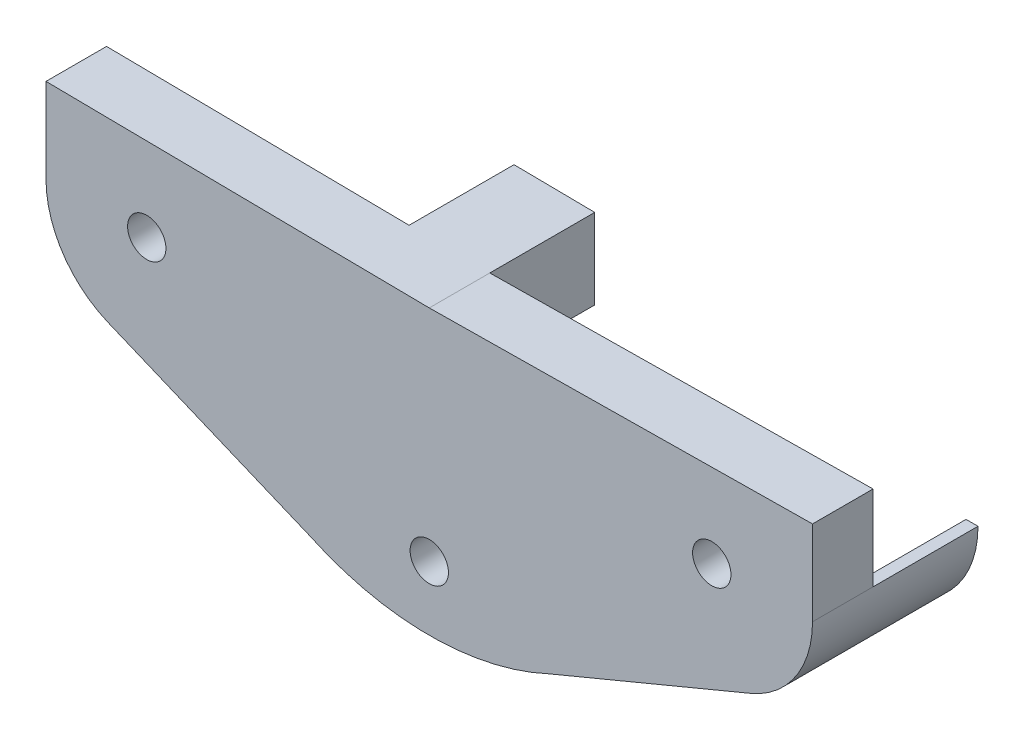
ISO-10303-21;
HEADER;
FILE_DESCRIPTION(('STEP AP214'),'2;1');
FILE_NAME('part.step','',(''),(''),'','','');
FILE_SCHEMA(('AUTOMOTIVE_DESIGN { 1 0 10303 214 1 1 1 1 }'));
ENDSEC;
DATA;
#1=APPLICATION_CONTEXT('core data for automotive mechanical design processes');
#2=APPLICATION_PROTOCOL_DEFINITION('international standard','automotive_design',2000,#1);
#3=PRODUCT_CONTEXT('',#1,'mechanical');
#4=PRODUCT('Part','Part','',(#3));
#5=PRODUCT_RELATED_PRODUCT_CATEGORY('part','',(#4));
#6=PRODUCT_DEFINITION_FORMATION('','',#4);
#7=PRODUCT_DEFINITION_CONTEXT('part definition',#1,'design');
#8=PRODUCT_DEFINITION('design','',#6,#7);
#9=PRODUCT_DEFINITION_SHAPE('','',#8);
#10=(LENGTH_UNIT() NAMED_UNIT(*) SI_UNIT(.MILLI.,.METRE.));
#11=(NAMED_UNIT(*) PLANE_ANGLE_UNIT() SI_UNIT($,.RADIAN.));
#12=(NAMED_UNIT(*) SI_UNIT($,.STERADIAN.) SOLID_ANGLE_UNIT());
#13=UNCERTAINTY_MEASURE_WITH_UNIT(LENGTH_MEASURE(1.E-05),#10,'distance_accuracy_value','');
#14=(GEOMETRIC_REPRESENTATION_CONTEXT(3) GLOBAL_UNCERTAINTY_ASSIGNED_CONTEXT((#13)) GLOBAL_UNIT_ASSIGNED_CONTEXT((#10,
#11,#12)) REPRESENTATION_CONTEXT('',''));
#15=CARTESIAN_POINT('',(0.,0.,0.));
#16=DIRECTION('',(0.,0.,1.));
#17=DIRECTION('',(1.,0.,0.));
#18=AXIS2_PLACEMENT_3D('',#15,#16,#17);
#19=CARTESIAN_POINT('',(-14.,0.0761161548422696,3.));
#20=DIRECTION('',(0.,0.,-1.));
#21=DIRECTION('',(-1.,0.,0.));
#22=AXIS2_PLACEMENT_3D('',#19,#20,#21);
#23=PLANE('',#22);
#24=DIRECTION('',(-0.999928879078218,-0.0119263064432308,0.));
#25=VECTOR('',#24,1.);
#26=CARTESIAN_POINT('',(18.9924278789332,4.2760258409828,3.));
#27=LINE('',#26,#25);
#28=CARTESIAN_POINT('',(18.9924278789332,4.2760258409828,3.));
#29=VERTEX_POINT('',#28);
#30=CARTESIAN_POINT('',(0.,4.04950021528638,3.));
#31=VERTEX_POINT('',#30);
#32=EDGE_CURVE('E225',#29,#31,#27,.T.);
#33=ORIENTED_EDGE('',*,*,#32,.T.);
#34=DIRECTION('',(-0.999928879078218,0.0119263064432308,0.));
#35=VECTOR('',#34,1.);
#36=CARTESIAN_POINT('',(-18.9924278789332,4.2760258409828,3.));
#37=LINE('',#36,#35);
#38=CARTESIAN_POINT('',(-18.9924278789332,4.2760258409828,3.));
#39=VERTEX_POINT('',#38);
#40=EDGE_CURVE('E228',#31,#39,#37,.T.);
#41=ORIENTED_EDGE('',*,*,#40,.T.);
#42=DIRECTION('',(0.,-1.,0.));
#43=VECTOR('',#42,1.);
#44=CARTESIAN_POINT('',(-18.9924278789332,0.0761161548422696,3.));
#45=LINE('',#44,#43);
#46=CARTESIAN_POINT('',(-18.9924278789332,0.0761161548422696,3.));
#47=VERTEX_POINT('',#46);
#48=EDGE_CURVE('E231',#39,#47,#45,.T.);
#49=ORIENTED_EDGE('',*,*,#48,.T.);
#50=CARTESIAN_POINT('',(-14.,0.0761161548422696,3.));
#51=DIRECTION('',(0.,0.,1.));
#52=DIRECTION('',(-1.,0.,0.));
#53=AXIS2_PLACEMENT_3D('',#50,#51,#52);
#54=CIRCLE('',#53,4.99242787893324);
#55=CARTESIAN_POINT('',(-15.9179901286796,-4.53318422511101,3.));
#56=VERTEX_POINT('',#55);
#57=EDGE_CURVE('E233',#47,#56,#54,.T.);
#58=ORIENTED_EDGE('',*,*,#57,.T.);
#59=DIRECTION('',(0.923258280686105,-0.384179836983328,0.));
#60=VECTOR('',#59,1.);
#61=CARTESIAN_POINT('',(-5.94246213828742,-8.68413179562563,3.));
#62=LINE('',#61,#60);
#63=CARTESIAN_POINT('',(-5.94246213828742,-8.68413179562563,3.));
#64=VERTEX_POINT('',#63);
#65=EDGE_CURVE('E235',#56,#64,#62,.T.);
#66=ORIENTED_EDGE('',*,*,#65,.T.);
#67=CARTESIAN_POINT('',(0.,4.04950021528638,3.));
#68=DIRECTION('',(0.,0.,1.));
#69=DIRECTION('',(1.,0.,0.));
#70=AXIS2_PLACEMENT_3D('',#67,#68,#69);
#71=CIRCLE('',#70,14.05198350605);
#72=CARTESIAN_POINT('',(5.94246213828742,-8.68413179562563,3.));
#73=VERTEX_POINT('',#72);
#74=EDGE_CURVE('E237',#64,#73,#71,.T.);
#75=ORIENTED_EDGE('',*,*,#74,.T.);
#76=DIRECTION('',(0.923258280686105,0.384179836983328,0.));
#77=VECTOR('',#76,1.);
#78=CARTESIAN_POINT('',(5.94246213828742,-8.68413179562563,3.));
#79=LINE('',#78,#77);
#80=CARTESIAN_POINT('',(15.9179901286796,-4.53318422511101,3.));
#81=VERTEX_POINT('',#80);
#82=EDGE_CURVE('E239',#73,#81,#79,.T.);
#83=ORIENTED_EDGE('',*,*,#82,.T.);
#84=CARTESIAN_POINT('',(14.,0.0761161548422696,3.));
#85=DIRECTION('',(0.,0.,1.));
#86=DIRECTION('',(1.,0.,0.));
#87=AXIS2_PLACEMENT_3D('',#84,#85,#86);
#88=CIRCLE('',#87,4.99242787893324);
#89=CARTESIAN_POINT('',(18.9924278789332,0.0761161548422696,3.));
#90=VERTEX_POINT('',#89);
#91=EDGE_CURVE('E241',#81,#90,#88,.T.);
#92=ORIENTED_EDGE('',*,*,#91,.T.);
#93=DIRECTION('',(0.,1.,0.));
#94=VECTOR('',#93,1.);
#95=CARTESIAN_POINT('',(18.9924278789332,0.0761161548422696,3.));
#96=LINE('',#95,#94);
#97=EDGE_CURVE('E243',#90,#29,#96,.T.);
#98=ORIENTED_EDGE('',*,*,#97,.T.);
#99=EDGE_LOOP('',(#33,#41,#49,#58,#66,#75,#83,#92,#98));
#100=FACE_BOUND('',#99,.T.);
#101=CARTESIAN_POINT('',(-14.,0.0761161548422696,3.));
#102=DIRECTION('',(0.,0.,1.));
#103=DIRECTION('',(1.,0.,0.));
#104=AXIS2_PLACEMENT_3D('',#101,#102,#103);
#105=CIRCLE('',#104,0.949999999999999);
#106=CARTESIAN_POINT('',(-13.05,0.0761161548422696,3.));
#107=VERTEX_POINT('',#106);
#108=EDGE_CURVE('E219',#107,#107,#105,.T.);
#109=ORIENTED_EDGE('',*,*,#108,.F.);
#110=EDGE_LOOP('',(#109));
#111=FACE_BOUND('',#110,.T.);
#112=CARTESIAN_POINT('',(14.,0.0761161548422696,3.));
#113=DIRECTION('',(0.,0.,1.));
#114=DIRECTION('',(-1.,0.,0.));
#115=AXIS2_PLACEMENT_3D('',#112,#113,#114);
#116=CIRCLE('',#115,0.949999999999999);
#117=CARTESIAN_POINT('',(13.05,0.0761161548422696,3.));
#118=VERTEX_POINT('',#117);
#119=EDGE_CURVE('E213',#118,#118,#116,.T.);
#120=ORIENTED_EDGE('',*,*,#119,.F.);
#121=EDGE_LOOP('',(#120));
#122=FACE_BOUND('',#121,.T.);
#123=CARTESIAN_POINT('',(0.,-6.83451712184535,3.));
#124=DIRECTION('',(0.,0.,1.));
#125=DIRECTION('',(1.,0.,0.));
#126=AXIS2_PLACEMENT_3D('',#123,#124,#125);
#127=CIRCLE('',#126,0.95);
#128=CARTESIAN_POINT('',(0.95,-6.83451712184535,3.));
#129=VERTEX_POINT('',#128);
#130=EDGE_CURVE('E207',#129,#129,#127,.T.);
#131=ORIENTED_EDGE('',*,*,#130,.F.);
#132=EDGE_LOOP('',(#131));
#133=FACE_BOUND('',#132,.T.);
#134=ADVANCED_FACE('F35',(#100,#111,#122,#133),#23,.F.);
#135=CARTESIAN_POINT('',(-14.,0.0761161548422696,0.));
#136=DIRECTION('',(0.,0.,-1.));
#137=DIRECTION('',(-1.,0.,0.));
#138=AXIS2_PLACEMENT_3D('',#135,#136,#137);
#139=PLANE('',#138);
#140=DIRECTION('',(0.,-1.,0.));
#141=VECTOR('',#140,1.);
#142=CARTESIAN_POINT('',(-3.99971551631287,0.,0.));
#143=LINE('',#142,#141);
#144=CARTESIAN_POINT('',(-3.99971551631287,4.0972054410593,0.));
#145=VERTEX_POINT('',#144);
#146=CARTESIAN_POINT('',(-3.99971551631287,0.,0.));
#147=VERTEX_POINT('',#146);
#148=EDGE_CURVE('E50',#145,#147,#143,.T.);
#149=ORIENTED_EDGE('',*,*,#148,.T.);
#150=DIRECTION('',(0.999818971255913,0.0190269471216064,0.));
#151=VECTOR('',#150,1.);
#152=CARTESIAN_POINT('',(-0.00144799587694737,0.0760885989128714,0.));
#153=LINE('',#152,#151);
#154=CARTESIAN_POINT('',(0.,0.0761161548422696,0.));
#155=VERTEX_POINT('',#154);
#156=EDGE_CURVE('E150',#147,#155,#153,.T.);
#157=ORIENTED_EDGE('',*,*,#156,.T.);
#158=DIRECTION('',(0.,-1.,0.));
#159=VECTOR('',#158,1.);
#160=CARTESIAN_POINT('',(0.,0.,0.));
#161=LINE('',#160,#159);
#162=CARTESIAN_POINT('',(0.,4.04950021528637,0.));
#163=VERTEX_POINT('',#162);
#164=EDGE_CURVE('E161',#163,#155,#161,.T.);
#165=ORIENTED_EDGE('',*,*,#164,.F.);
#166=DIRECTION('',(-0.999928879078218,-0.0119263064432308,0.));
#167=VECTOR('',#166,1.);
#168=CARTESIAN_POINT('',(18.9924278789332,4.2760258409828,0.));
#169=LINE('',#168,#167);
#170=CARTESIAN_POINT('',(18.9924278789332,4.2760258409828,0.));
#171=VERTEX_POINT('',#170);
#172=EDGE_CURVE('E222',#171,#163,#169,.T.);
#173=ORIENTED_EDGE('',*,*,#172,.F.);
#174=DIRECTION('',(0.,1.,0.));
#175=VECTOR('',#174,1.);
#176=CARTESIAN_POINT('',(18.9924278789332,0.0761161548422696,0.));
#177=LINE('',#176,#175);
#178=CARTESIAN_POINT('',(18.9924278789332,0.0761161548422696,0.));
#179=VERTEX_POINT('',#178);
#180=EDGE_CURVE('E229',#179,#171,#177,.T.);
#181=ORIENTED_EDGE('',*,*,#180,.F.);
#182=DIRECTION('',(1.,0.,0.));
#183=VECTOR('',#182,1.);
#184=CARTESIAN_POINT('',(0.,0.0761161548422733,0.));
#185=LINE('',#184,#183);
#186=CARTESIAN_POINT('',(18.4,0.0761161548422704,0.));
#187=VERTEX_POINT('',#186);
#188=EDGE_CURVE('E191',#187,#179,#185,.T.);
#189=ORIENTED_EDGE('',*,*,#188,.F.);
#190=CARTESIAN_POINT('',(14.,0.0761161548422696,0.));
#191=DIRECTION('',(0.,0.,-1.));
#192=DIRECTION('',(-1.,0.,0.));
#193=AXIS2_PLACEMENT_3D('',#190,#191,#192);
#194=CIRCLE('',#193,4.4);
#195=CARTESIAN_POINT('',(15.6903912827266,-3.98622028017659,0.));
#196=VERTEX_POINT('',#195);
#197=EDGE_CURVE('E58',#187,#196,#194,.T.);
#198=ORIENTED_EDGE('',*,*,#197,.T.);
#199=DIRECTION('',(-0.384179836983324,0.923258280686107,0.));
#200=VECTOR('',#199,1.);
#201=CARTESIAN_POINT('',(11.960680128174,4.97699531970277,0.));
#202=LINE('',#201,#200);
#203=CARTESIAN_POINT('',(15.9179901286796,-4.53318422511101,0.));
#204=VERTEX_POINT('',#203);
#205=EDGE_CURVE('E183',#204,#196,#202,.T.);
#206=ORIENTED_EDGE('',*,*,#205,.F.);
#207=DIRECTION('',(0.923258280686105,0.384179836983328,0.));
#208=VECTOR('',#207,1.);
#209=CARTESIAN_POINT('',(5.94246213828742,-8.68413179562563,0.));
#210=LINE('',#209,#208);
#211=CARTESIAN_POINT('',(5.94246213828742,-8.68413179562563,0.));
#212=VERTEX_POINT('',#211);
#213=EDGE_CURVE('E258',#212,#204,#210,.T.);
#214=ORIENTED_EDGE('',*,*,#213,.F.);
#215=CARTESIAN_POINT('',(0.,4.04950021528638,0.));
#216=DIRECTION('',(0.,0.,1.));
#217=DIRECTION('',(1.,0.,0.));
#218=AXIS2_PLACEMENT_3D('',#215,#216,#217);
#219=CIRCLE('',#218,14.05198350605);
#220=CARTESIAN_POINT('',(-5.94246213828742,-8.68413179562563,0.));
#221=VERTEX_POINT('',#220);
#222=EDGE_CURVE('E256',#221,#212,#219,.T.);
#223=ORIENTED_EDGE('',*,*,#222,.F.);
#224=DIRECTION('',(0.923258280686105,-0.384179836983328,0.));
#225=VECTOR('',#224,1.);
#226=CARTESIAN_POINT('',(-5.94246213828742,-8.68413179562563,0.));
#227=LINE('',#226,#225);
#228=CARTESIAN_POINT('',(-15.9179901286796,-4.53318422511101,0.));
#229=VERTEX_POINT('',#228);
#230=EDGE_CURVE('E254',#229,#221,#227,.T.);
#231=ORIENTED_EDGE('',*,*,#230,.F.);
#232=CARTESIAN_POINT('',(-14.,0.0761161548422696,0.));
#233=DIRECTION('',(0.,0.,1.));
#234=DIRECTION('',(-1.,0.,0.));
#235=AXIS2_PLACEMENT_3D('',#232,#233,#234);
#236=CIRCLE('',#235,4.99242787893324);
#237=CARTESIAN_POINT('',(-18.9924278789332,0.0761161548422696,0.));
#238=VERTEX_POINT('',#237);
#239=EDGE_CURVE('E252',#238,#229,#236,.T.);
#240=ORIENTED_EDGE('',*,*,#239,.F.);
#241=DIRECTION('',(0.,-1.,0.));
#242=VECTOR('',#241,1.);
#243=CARTESIAN_POINT('',(-18.9924278789332,0.0761161548422696,0.));
#244=LINE('',#243,#242);
#245=CARTESIAN_POINT('',(-18.9924278789332,4.2760258409828,0.));
#246=VERTEX_POINT('',#245);
#247=EDGE_CURVE('E250',#246,#238,#244,.T.);
#248=ORIENTED_EDGE('',*,*,#247,.F.);
#249=DIRECTION('',(-0.999928879078218,0.0119263064432308,0.));
#250=VECTOR('',#249,1.);
#251=CARTESIAN_POINT('',(-18.9924278789332,4.2760258409828,0.));
#252=LINE('',#251,#250);
#253=EDGE_CURVE('E248',#145,#246,#252,.T.);
#254=ORIENTED_EDGE('',*,*,#253,.F.);
#255=EDGE_LOOP('',(#149,#157,#165,#173,#181,#189,#198,#206,#214,#223,#231,#240,#248,#254));
#256=FACE_BOUND('',#255,.T.);
#257=CARTESIAN_POINT('',(14.,0.0761161548422696,0.));
#258=DIRECTION('',(0.,0.,1.));
#259=DIRECTION('',(-1.,0.,0.));
#260=AXIS2_PLACEMENT_3D('',#257,#258,#259);
#261=CIRCLE('',#260,0.949999999999999);
#262=CARTESIAN_POINT('',(13.05,0.0761161548422696,0.));
#263=VERTEX_POINT('',#262);
#264=EDGE_CURVE('E210',#263,#263,#261,.T.);
#265=ORIENTED_EDGE('',*,*,#264,.T.);
#266=EDGE_LOOP('',(#265));
#267=FACE_BOUND('',#266,.T.);
#268=CARTESIAN_POINT('',(-14.,0.0761161548422696,0.));
#269=DIRECTION('',(0.,0.,1.));
#270=DIRECTION('',(1.,0.,0.));
#271=AXIS2_PLACEMENT_3D('',#268,#269,#270);
#272=CIRCLE('',#271,0.949999999999999);
#273=CARTESIAN_POINT('',(-13.05,0.0761161548422696,0.));
#274=VERTEX_POINT('',#273);
#275=EDGE_CURVE('E216',#274,#274,#272,.T.);
#276=ORIENTED_EDGE('',*,*,#275,.T.);
#277=EDGE_LOOP('',(#276));
#278=FACE_BOUND('',#277,.T.);
#279=CARTESIAN_POINT('',(0.,-6.83451712184535,0.));
#280=DIRECTION('',(0.,0.,1.));
#281=DIRECTION('',(1.,0.,0.));
#282=AXIS2_PLACEMENT_3D('',#279,#280,#281);
#283=CIRCLE('',#282,0.95);
#284=CARTESIAN_POINT('',(0.95,-6.83451712184535,0.));
#285=VERTEX_POINT('',#284);
#286=EDGE_CURVE('E206',#285,#285,#283,.T.);
#287=ORIENTED_EDGE('',*,*,#286,.T.);
#288=EDGE_LOOP('',(#287));
#289=FACE_BOUND('',#288,.T.);
#290=ADVANCED_FACE('F291',(#256,#267,#278,#289),#139,.T.);
#291=CARTESIAN_POINT('',(18.9924278789332,4.2760258409828,3.));
#292=DIRECTION('',(0.0119263064432308,-0.999928879078218,0.));
#293=DIRECTION('',(0.999928879078218,0.0119263064432308,0.));
#294=AXIS2_PLACEMENT_3D('',#291,#292,#293);
#295=PLANE('',#294);
#296=ORIENTED_EDGE('',*,*,#172,.T.);
#297=DIRECTION('',(0.,0.,-1.));
#298=VECTOR('',#297,1.);
#299=CARTESIAN_POINT('',(0.,4.04950021528638,3.));
#300=LINE('',#299,#298);
#301=EDGE_CURVE('E11',#31,#163,#300,.T.);
#302=ORIENTED_EDGE('',*,*,#301,.F.);
#303=ORIENTED_EDGE('',*,*,#32,.F.);
#304=DIRECTION('',(0.,0.,-1.));
#305=VECTOR('',#304,1.);
#306=CARTESIAN_POINT('',(18.9924278789332,4.2760258409828,3.));
#307=LINE('',#306,#305);
#308=EDGE_CURVE('E245',#29,#171,#307,.T.);
#309=ORIENTED_EDGE('',*,*,#308,.T.);
#310=EDGE_LOOP('',(#296,#302,#303,#309));
#311=FACE_BOUND('',#310,.T.);
#312=ADVANCED_FACE('F37',(#311),#295,.F.);
#313=CARTESIAN_POINT('',(-18.9924278789332,4.2760258409828,3.));
#314=DIRECTION('',(-0.0119263064432308,-0.999928879078218,0.));
#315=DIRECTION('',(0.999928879078218,-0.0119263064432308,0.));
#316=AXIS2_PLACEMENT_3D('',#313,#314,#315);
#317=PLANE('',#316);
#318=ORIENTED_EDGE('',*,*,#301,.T.);
#319=DIRECTION('',(0.,0.,1.));
#320=VECTOR('',#319,1.);
#321=CARTESIAN_POINT('',(0.,4.04950021528637,-5.2));
#322=LINE('',#321,#320);
#323=CARTESIAN_POINT('',(0.,4.04950021528637,-5.2));
#324=VERTEX_POINT('',#323);
#325=EDGE_CURVE('E176',#324,#163,#322,.T.);
#326=ORIENTED_EDGE('',*,*,#325,.F.);
#327=DIRECTION('',(0.999928879078218,-0.0119263064432308,0.));
#328=VECTOR('',#327,1.);
#329=CARTESIAN_POINT('',(0.0482921456832308,4.04892422739337,-5.2));
#330=LINE('',#329,#328);
#331=CARTESIAN_POINT('',(-3.99971551631287,4.0972054410593,-5.2));
#332=VERTEX_POINT('',#331);
#333=EDGE_CURVE('E165',#332,#324,#330,.T.);
#334=ORIENTED_EDGE('',*,*,#333,.F.);
#335=DIRECTION('',(0.,0.,1.));
#336=VECTOR('',#335,1.);
#337=CARTESIAN_POINT('',(-3.99971551631287,4.0972054410593,-5.2));
#338=LINE('',#337,#336);
#339=EDGE_CURVE('E152',#332,#145,#338,.T.);
#340=ORIENTED_EDGE('',*,*,#339,.T.);
#341=ORIENTED_EDGE('',*,*,#253,.T.);
#342=DIRECTION('',(0.,0.,-1.));
#343=VECTOR('',#342,1.);
#344=CARTESIAN_POINT('',(-18.9924278789332,4.2760258409828,3.));
#345=LINE('',#344,#343);
#346=EDGE_CURVE('E43',#39,#246,#345,.T.);
#347=ORIENTED_EDGE('',*,*,#346,.F.);
#348=ORIENTED_EDGE('',*,*,#40,.F.);
#349=EDGE_LOOP('',(#318,#326,#334,#340,#341,#347,#348));
#350=FACE_BOUND('',#349,.T.);
#351=ADVANCED_FACE('F309',(#350),#317,.F.);
#352=CARTESIAN_POINT('',(-18.9924278789332,0.0761161548422696,3.));
#353=DIRECTION('',(1.,0.,0.));
#354=DIRECTION('',(0.,0.,-1.));
#355=AXIS2_PLACEMENT_3D('',#352,#353,#354);
#356=PLANE('',#355);
#357=ORIENTED_EDGE('',*,*,#247,.T.);
#358=DIRECTION('',(0.,0.,-1.));
#359=VECTOR('',#358,1.);
#360=CARTESIAN_POINT('',(-18.9924278789332,0.0761161548422696,3.));
#361=LINE('',#360,#359);
#362=EDGE_CURVE('E279',#47,#238,#361,.T.);
#363=ORIENTED_EDGE('',*,*,#362,.F.);
#364=ORIENTED_EDGE('',*,*,#48,.F.);
#365=ORIENTED_EDGE('',*,*,#346,.T.);
#366=EDGE_LOOP('',(#357,#363,#364,#365));
#367=FACE_BOUND('',#366,.T.);
#368=ADVANCED_FACE('F286',(#367),#356,.F.);
#369=CARTESIAN_POINT('',(-14.,0.0761161548422696,3.));
#370=DIRECTION('',(0.,0.,-1.));
#371=DIRECTION('',(-1.,0.,0.));
#372=AXIS2_PLACEMENT_3D('',#369,#370,#371);
#373=CYLINDRICAL_SURFACE('',#372,4.99242787893324);
#374=ORIENTED_EDGE('',*,*,#239,.T.);
#375=DIRECTION('',(0.,0.,-1.));
#376=VECTOR('',#375,1.);
#377=CARTESIAN_POINT('',(-15.9179901286796,-4.53318422511101,3.));
#378=LINE('',#377,#376);
#379=EDGE_CURVE('E276',#56,#229,#378,.T.);
#380=ORIENTED_EDGE('',*,*,#379,.F.);
#381=ORIENTED_EDGE('',*,*,#57,.F.);
#382=ORIENTED_EDGE('',*,*,#362,.T.);
#383=EDGE_LOOP('',(#374,#380,#381,#382));
#384=FACE_BOUND('',#383,.T.);
#385=ADVANCED_FACE('F297',(#384),#373,.T.);
#386=CARTESIAN_POINT('',(-5.94246213828742,-8.68413179562563,3.));
#387=DIRECTION('',(0.384179836983328,0.923258280686105,0.));
#388=DIRECTION('',(-0.923258280686105,0.384179836983328,0.));
#389=AXIS2_PLACEMENT_3D('',#386,#387,#388);
#390=PLANE('',#389);
#391=ORIENTED_EDGE('',*,*,#230,.T.);
#392=DIRECTION('',(0.,0.,-1.));
#393=VECTOR('',#392,1.);
#394=CARTESIAN_POINT('',(-5.94246213828742,-8.68413179562563,3.));
#395=LINE('',#394,#393);
#396=EDGE_CURVE('E273',#64,#221,#395,.T.);
#397=ORIENTED_EDGE('',*,*,#396,.F.);
#398=ORIENTED_EDGE('',*,*,#65,.F.);
#399=ORIENTED_EDGE('',*,*,#379,.T.);
#400=EDGE_LOOP('',(#391,#397,#398,#399));
#401=FACE_BOUND('',#400,.T.);
#402=ADVANCED_FACE('F301',(#401),#390,.F.);
#403=CARTESIAN_POINT('',(0.,4.04950021528638,3.));
#404=DIRECTION('',(0.,0.,-1.));
#405=DIRECTION('',(-1.,0.,0.));
#406=AXIS2_PLACEMENT_3D('',#403,#404,#405);
#407=CYLINDRICAL_SURFACE('',#406,14.05198350605);
#408=ORIENTED_EDGE('',*,*,#222,.T.);
#409=DIRECTION('',(0.,0.,-1.));
#410=VECTOR('',#409,1.);
#411=CARTESIAN_POINT('',(5.94246213828742,-8.68413179562563,3.));
#412=LINE('',#411,#410);
#413=EDGE_CURVE('E270',#73,#212,#412,.T.);
#414=ORIENTED_EDGE('',*,*,#413,.F.);
#415=ORIENTED_EDGE('',*,*,#74,.F.);
#416=ORIENTED_EDGE('',*,*,#396,.T.);
#417=EDGE_LOOP('',(#408,#414,#415,#416));
#418=FACE_BOUND('',#417,.T.);
#419=ADVANCED_FACE('F346',(#418),#407,.T.);
#420=CARTESIAN_POINT('',(5.94246213828742,-8.68413179562563,3.));
#421=DIRECTION('',(-0.384179836983328,0.923258280686105,0.));
#422=DIRECTION('',(-0.923258280686105,-0.384179836983328,0.));
#423=AXIS2_PLACEMENT_3D('',#420,#421,#422);
#424=PLANE('',#423);
#425=ORIENTED_EDGE('',*,*,#213,.T.);
#426=DIRECTION('',(0.,0.,-1.));
#427=VECTOR('',#426,1.);
#428=CARTESIAN_POINT('',(15.9179901286796,-4.53318422511101,3.));
#429=LINE('',#428,#427);
#430=EDGE_CURVE('E267',#81,#204,#429,.T.);
#431=ORIENTED_EDGE('',*,*,#430,.F.);
#432=ORIENTED_EDGE('',*,*,#82,.F.);
#433=ORIENTED_EDGE('',*,*,#413,.T.);
#434=EDGE_LOOP('',(#425,#431,#432,#433));
#435=FACE_BOUND('',#434,.T.);
#436=ADVANCED_FACE('F342',(#435),#424,.F.);
#437=CARTESIAN_POINT('',(14.,0.0761161548422696,3.));
#438=DIRECTION('',(0.,0.,-1.));
#439=DIRECTION('',(-1.,0.,0.));
#440=AXIS2_PLACEMENT_3D('',#437,#438,#439);
#441=CYLINDRICAL_SURFACE('',#440,4.99242787893324);
#442=ORIENTED_EDGE('',*,*,#430,.T.);
#443=DIRECTION('',(0.,0.,1.));
#444=VECTOR('',#443,1.);
#445=CARTESIAN_POINT('',(15.9179901286796,-4.53318422511101,-5.2));
#446=LINE('',#445,#444);
#447=CARTESIAN_POINT('',(15.9179901286796,-4.53318422511101,-5.2));
#448=VERTEX_POINT('',#447);
#449=EDGE_CURVE('E197',#448,#204,#446,.T.);
#450=ORIENTED_EDGE('',*,*,#449,.F.);
#451=CARTESIAN_POINT('',(14.,0.0761161548422696,-5.2));
#452=DIRECTION('',(0.,0.,-1.));
#453=DIRECTION('',(-1.,0.,0.));
#454=AXIS2_PLACEMENT_3D('',#451,#452,#453);
#455=CIRCLE('',#454,4.99242787893324);
#456=CARTESIAN_POINT('',(18.9924278789332,0.0761161548422696,-5.2));
#457=VERTEX_POINT('',#456);
#458=EDGE_CURVE('E185',#457,#448,#455,.T.);
#459=ORIENTED_EDGE('',*,*,#458,.F.);
#460=DIRECTION('',(0.,0.,1.));
#461=VECTOR('',#460,1.);
#462=CARTESIAN_POINT('',(18.9924278789332,0.0761161548422696,-5.2));
#463=LINE('',#462,#461);
#464=EDGE_CURVE('E200',#457,#179,#463,.T.);
#465=ORIENTED_EDGE('',*,*,#464,.T.);
#466=DIRECTION('',(0.,0.,-1.));
#467=VECTOR('',#466,1.);
#468=CARTESIAN_POINT('',(18.9924278789332,0.0761161548422696,3.));
#469=LINE('',#468,#467);
#470=EDGE_CURVE('E264',#90,#179,#469,.T.);
#471=ORIENTED_EDGE('',*,*,#470,.F.);
#472=ORIENTED_EDGE('',*,*,#91,.F.);
#473=EDGE_LOOP('',(#442,#450,#459,#465,#471,#472));
#474=FACE_BOUND('',#473,.T.);
#475=ADVANCED_FACE('F338',(#474),#441,.T.);
#476=CARTESIAN_POINT('',(18.9924278789332,0.0761161548422696,3.));
#477=DIRECTION('',(-1.,0.,0.));
#478=DIRECTION('',(0.,0.,1.));
#479=AXIS2_PLACEMENT_3D('',#476,#477,#478);
#480=PLANE('',#479);
#481=ORIENTED_EDGE('',*,*,#180,.T.);
#482=ORIENTED_EDGE('',*,*,#308,.F.);
#483=ORIENTED_EDGE('',*,*,#97,.F.);
#484=ORIENTED_EDGE('',*,*,#470,.T.);
#485=EDGE_LOOP('',(#481,#482,#483,#484));
#486=FACE_BOUND('',#485,.T.);
#487=ADVANCED_FACE('F335',(#486),#480,.F.);
#488=CARTESIAN_POINT('',(-14.,0.0761161548422696,3.));
#489=DIRECTION('',(0.,0.,-1.));
#490=DIRECTION('',(-1.,0.,0.));
#491=AXIS2_PLACEMENT_3D('',#488,#489,#490);
#492=CYLINDRICAL_SURFACE('',#491,0.949999999999999);
#493=ORIENTED_EDGE('',*,*,#108,.T.);
#494=EDGE_LOOP('',(#493));
#495=FACE_BOUND('',#494,.T.);
#496=ORIENTED_EDGE('',*,*,#275,.F.);
#497=EDGE_LOOP('',(#496));
#498=FACE_BOUND('',#497,.T.);
#499=ADVANCED_FACE('F332',(#495,#498),#492,.F.);
#500=CARTESIAN_POINT('',(14.,0.0761161548422696,3.));
#501=DIRECTION('',(0.,0.,-1.));
#502=DIRECTION('',(-1.,0.,0.));
#503=AXIS2_PLACEMENT_3D('',#500,#501,#502);
#504=CYLINDRICAL_SURFACE('',#503,0.949999999999999);
#505=ORIENTED_EDGE('',*,*,#119,.T.);
#506=EDGE_LOOP('',(#505));
#507=FACE_BOUND('',#506,.T.);
#508=ORIENTED_EDGE('',*,*,#264,.F.);
#509=EDGE_LOOP('',(#508));
#510=FACE_BOUND('',#509,.T.);
#511=ADVANCED_FACE('F378',(#507,#510),#504,.F.);
#512=CARTESIAN_POINT('',(0.,-6.83451712184535,3.));
#513=DIRECTION('',(0.,0.,-1.));
#514=DIRECTION('',(-1.,0.,0.));
#515=AXIS2_PLACEMENT_3D('',#512,#513,#514);
#516=CYLINDRICAL_SURFACE('',#515,0.95);
#517=ORIENTED_EDGE('',*,*,#130,.T.);
#518=EDGE_LOOP('',(#517));
#519=FACE_BOUND('',#518,.T.);
#520=ORIENTED_EDGE('',*,*,#286,.F.);
#521=EDGE_LOOP('',(#520));
#522=FACE_BOUND('',#521,.T.);
#523=ADVANCED_FACE('F372',(#519,#522),#516,.F.);
#524=CARTESIAN_POINT('',(14.,0.0761161548422696,-5.2));
#525=DIRECTION('',(0.,0.,1.));
#526=DIRECTION('',(1.,0.,0.));
#527=AXIS2_PLACEMENT_3D('',#524,#525,#526);
#528=CYLINDRICAL_SURFACE('',#527,4.4);
#529=ORIENTED_EDGE('',*,*,#197,.F.);
#530=DIRECTION('',(0.,0.,1.));
#531=VECTOR('',#530,1.);
#532=CARTESIAN_POINT('',(18.4,0.0761161548422704,-5.2));
#533=LINE('',#532,#531);
#534=CARTESIAN_POINT('',(18.4,0.0761161548422704,-5.2));
#535=VERTEX_POINT('',#534);
#536=EDGE_CURVE('E203',#535,#187,#533,.T.);
#537=ORIENTED_EDGE('',*,*,#536,.F.);
#538=CARTESIAN_POINT('',(14.,0.0761161548422696,-5.2));
#539=DIRECTION('',(0.,0.,-1.));
#540=DIRECTION('',(-1.,0.,0.));
#541=AXIS2_PLACEMENT_3D('',#538,#539,#540);
#542=CIRCLE('',#541,4.4);
#543=CARTESIAN_POINT('',(15.6903912827266,-3.98622028017659,-5.2));
#544=VERTEX_POINT('',#543);
#545=EDGE_CURVE('E179',#535,#544,#542,.T.);
#546=ORIENTED_EDGE('',*,*,#545,.T.);
#547=DIRECTION('',(0.,0.,1.));
#548=VECTOR('',#547,1.);
#549=CARTESIAN_POINT('',(15.6903912827266,-3.98622028017659,-5.2));
#550=LINE('',#549,#548);
#551=EDGE_CURVE('E189',#544,#196,#550,.T.);
#552=ORIENTED_EDGE('',*,*,#551,.T.);
#553=EDGE_LOOP('',(#529,#537,#546,#552));
#554=FACE_BOUND('',#553,.T.);
#555=ADVANCED_FACE('F377',(#554),#528,.F.);
#556=CARTESIAN_POINT('',(0.,0.0761161548422733,-5.2));
#557=DIRECTION('',(0.,-1.,0.));
#558=DIRECTION('',(1.,0.,0.));
#559=AXIS2_PLACEMENT_3D('',#556,#557,#558);
#560=PLANE('',#559);
#561=ORIENTED_EDGE('',*,*,#188,.T.);
#562=ORIENTED_EDGE('',*,*,#464,.F.);
#563=DIRECTION('',(1.,0.,0.));
#564=VECTOR('',#563,1.);
#565=CARTESIAN_POINT('',(0.,0.0761161548422733,-5.2));
#566=LINE('',#565,#564);
#567=EDGE_CURVE('E182',#535,#457,#566,.T.);
#568=ORIENTED_EDGE('',*,*,#567,.F.);
#569=ORIENTED_EDGE('',*,*,#536,.T.);
#570=EDGE_LOOP('',(#561,#562,#568,#569));
#571=FACE_BOUND('',#570,.T.);
#572=ADVANCED_FACE('F463',(#571),#560,.F.);
#573=CARTESIAN_POINT('',(11.960680128174,4.97699531970277,-5.2));
#574=DIRECTION('',(0.923258280686107,0.384179836983324,0.));
#575=DIRECTION('',(-0.384179836983324,0.923258280686107,0.));
#576=AXIS2_PLACEMENT_3D('',#573,#574,#575);
#577=PLANE('',#576);
#578=ORIENTED_EDGE('',*,*,#205,.T.);
#579=ORIENTED_EDGE('',*,*,#551,.F.);
#580=DIRECTION('',(-0.384179836983324,0.923258280686107,0.));
#581=VECTOR('',#580,1.);
#582=CARTESIAN_POINT('',(11.960680128174,4.97699531970277,-5.2));
#583=LINE('',#582,#581);
#584=EDGE_CURVE('E187',#448,#544,#583,.T.);
#585=ORIENTED_EDGE('',*,*,#584,.F.);
#586=ORIENTED_EDGE('',*,*,#449,.T.);
#587=EDGE_LOOP('',(#578,#579,#585,#586));
#588=FACE_BOUND('',#587,.T.);
#589=ADVANCED_FACE('F472',(#588),#577,.F.);
#590=CARTESIAN_POINT('',(0.,0.,-5.2));
#591=DIRECTION('',(0.,0.,-1.));
#592=DIRECTION('',(-1.,0.,0.));
#593=AXIS2_PLACEMENT_3D('',#590,#591,#592);
#594=PLANE('',#593);
#595=ORIENTED_EDGE('',*,*,#545,.F.);
#596=ORIENTED_EDGE('',*,*,#567,.T.);
#597=ORIENTED_EDGE('',*,*,#458,.T.);
#598=ORIENTED_EDGE('',*,*,#584,.T.);
#599=EDGE_LOOP('',(#595,#596,#597,#598));
#600=FACE_BOUND('',#599,.T.);
#601=ADVANCED_FACE('F481',(#600),#594,.T.);
#602=CARTESIAN_POINT('',(-0.00144799587694737,0.0760885989128714,-5.2));
#603=DIRECTION('',(0.0190269471216064,-0.999818971255913,0.));
#604=DIRECTION('',(0.999818971255913,0.0190269471216064,0.));
#605=AXIS2_PLACEMENT_3D('',#602,#603,#604);
#606=PLANE('',#605);
#607=ORIENTED_EDGE('',*,*,#156,.F.);
#608=DIRECTION('',(0.,0.,1.));
#609=VECTOR('',#608,1.);
#610=CARTESIAN_POINT('',(-3.99971551631287,0.,-5.2));
#611=LINE('',#610,#609);
#612=CARTESIAN_POINT('',(-3.99971551631287,0.,-5.2));
#613=VERTEX_POINT('',#612);
#614=EDGE_CURVE('E145',#613,#147,#611,.T.);
#615=ORIENTED_EDGE('',*,*,#614,.F.);
#616=DIRECTION('',(0.999818971255913,0.0190269471216064,0.));
#617=VECTOR('',#616,1.);
#618=CARTESIAN_POINT('',(-0.00144799587694737,0.0760885989128714,-5.2));
#619=LINE('',#618,#617);
#620=CARTESIAN_POINT('',(0.,0.0761161548422696,-5.2));
#621=VERTEX_POINT('',#620);
#622=EDGE_CURVE('E148',#613,#621,#619,.T.);
#623=ORIENTED_EDGE('',*,*,#622,.T.);
#624=DIRECTION('',(0.,0.,1.));
#625=VECTOR('',#624,1.);
#626=CARTESIAN_POINT('',(0.,0.0761161548422696,-5.2));
#627=LINE('',#626,#625);
#628=EDGE_CURVE('E170',#621,#155,#627,.T.);
#629=ORIENTED_EDGE('',*,*,#628,.T.);
#630=EDGE_LOOP('',(#607,#615,#623,#629));
#631=FACE_BOUND('',#630,.T.);
#632=ADVANCED_FACE('F147',(#631),#606,.T.);
#633=CARTESIAN_POINT('',(-3.99971551631287,0.,-5.2));
#634=DIRECTION('',(-1.,0.,0.));
#635=DIRECTION('',(0.,0.,1.));
#636=AXIS2_PLACEMENT_3D('',#633,#634,#635);
#637=PLANE('',#636);
#638=ORIENTED_EDGE('',*,*,#148,.F.);
#639=ORIENTED_EDGE('',*,*,#339,.F.);
#640=DIRECTION('',(0.,-1.,0.));
#641=VECTOR('',#640,1.);
#642=CARTESIAN_POINT('',(-3.99971551631287,0.,-5.2));
#643=LINE('',#642,#641);
#644=EDGE_CURVE('E157',#332,#613,#643,.T.);
#645=ORIENTED_EDGE('',*,*,#644,.T.);
#646=ORIENTED_EDGE('',*,*,#614,.T.);
#647=EDGE_LOOP('',(#638,#639,#645,#646));
#648=FACE_BOUND('',#647,.T.);
#649=ADVANCED_FACE('F163',(#648),#637,.T.);
#650=CARTESIAN_POINT('',(0.,0.,-5.2));
#651=DIRECTION('',(-1.,0.,0.));
#652=DIRECTION('',(0.,0.,1.));
#653=AXIS2_PLACEMENT_3D('',#650,#651,#652);
#654=PLANE('',#653);
#655=ORIENTED_EDGE('',*,*,#164,.T.);
#656=ORIENTED_EDGE('',*,*,#628,.F.);
#657=DIRECTION('',(0.,-1.,0.));
#658=VECTOR('',#657,1.);
#659=CARTESIAN_POINT('',(0.,0.,-5.2));
#660=LINE('',#659,#658);
#661=EDGE_CURVE('E159',#324,#621,#660,.T.);
#662=ORIENTED_EDGE('',*,*,#661,.F.);
#663=ORIENTED_EDGE('',*,*,#325,.T.);
#664=EDGE_LOOP('',(#655,#656,#662,#663));
#665=FACE_BOUND('',#664,.T.);
#666=ADVANCED_FACE('F316',(#665),#654,.F.);
#667=CARTESIAN_POINT('',(0.,0.,-5.2));
#668=DIRECTION('',(0.,0.,-1.));
#669=DIRECTION('',(-1.,0.,0.));
#670=AXIS2_PLACEMENT_3D('',#667,#668,#669);
#671=PLANE('',#670);
#672=ORIENTED_EDGE('',*,*,#622,.F.);
#673=ORIENTED_EDGE('',*,*,#644,.F.);
#674=ORIENTED_EDGE('',*,*,#333,.T.);
#675=ORIENTED_EDGE('',*,*,#661,.T.);
#676=EDGE_LOOP('',(#672,#673,#674,#675));
#677=FACE_BOUND('',#676,.T.);
#678=ADVANCED_FACE('F156',(#677),#671,.T.);
#679=CLOSED_SHELL('',(#134,#290,#312,#351,#368,#385,#402,#419,#436,#475,#487,#499,#511,#523,
#555,#572,#589,#601,#632,#649,#666,#678));
#680=MANIFOLD_SOLID_BREP('B2',#679);
#681=ADVANCED_BREP_SHAPE_REPRESENTATION('',(#18,#680),#14);
#682=SHAPE_DEFINITION_REPRESENTATION(#9,#681);
ENDSEC;
END-ISO-10303-21;
